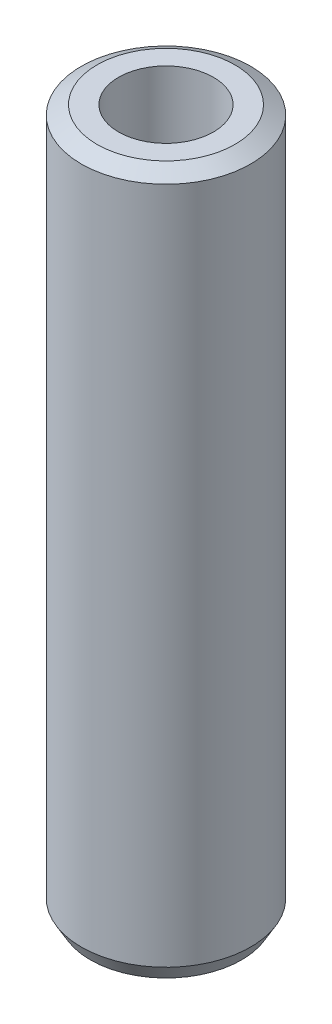
ISO-10303-21;
HEADER;
FILE_DESCRIPTION(('STEP AP214'),'2;1');
FILE_NAME('part.step','',(''),(''),'','','');
FILE_SCHEMA(('AUTOMOTIVE_DESIGN { 1 0 10303 214 1 1 1 1 }'));
ENDSEC;
DATA;
#1=APPLICATION_CONTEXT('core data for automotive mechanical design processes');
#2=APPLICATION_PROTOCOL_DEFINITION('international standard','automotive_design',2000,#1);
#3=PRODUCT_CONTEXT('',#1,'mechanical');
#4=PRODUCT('Part','Part','',(#3));
#5=PRODUCT_RELATED_PRODUCT_CATEGORY('part','',(#4));
#6=PRODUCT_DEFINITION_FORMATION('','',#4);
#7=PRODUCT_DEFINITION_CONTEXT('part definition',#1,'design');
#8=PRODUCT_DEFINITION('design','',#6,#7);
#9=PRODUCT_DEFINITION_SHAPE('','',#8);
#10=(LENGTH_UNIT() NAMED_UNIT(*) SI_UNIT(.MILLI.,.METRE.));
#11=(NAMED_UNIT(*) PLANE_ANGLE_UNIT() SI_UNIT($,.RADIAN.));
#12=(NAMED_UNIT(*) SI_UNIT($,.STERADIAN.) SOLID_ANGLE_UNIT());
#13=UNCERTAINTY_MEASURE_WITH_UNIT(LENGTH_MEASURE(1.E-05),#10,'distance_accuracy_value','');
#14=(GEOMETRIC_REPRESENTATION_CONTEXT(3) GLOBAL_UNCERTAINTY_ASSIGNED_CONTEXT((#13)) GLOBAL_UNIT_ASSIGNED_CONTEXT((#10,
#11,#12)) REPRESENTATION_CONTEXT('',''));
#15=CARTESIAN_POINT('',(0.,0.,0.));
#16=DIRECTION('',(0.,0.,1.));
#17=DIRECTION('',(1.,0.,0.));
#18=AXIS2_PLACEMENT_3D('',#15,#16,#17);
#19=CARTESIAN_POINT('',(0.,124.492116500997,0.));
#20=DIRECTION('',(0.,-1.,0.));
#21=DIRECTION('',(0.,0.,-1.));
#22=AXIS2_PLACEMENT_3D('',#19,#20,#21);
#23=CYLINDRICAL_SURFACE('',#22,15.);
#24=CARTESIAN_POINT('',(0.,122.883751197156,0.));
#25=DIRECTION('',(0.,1.,0.));
#26=DIRECTION('',(0.,0.,1.));
#27=AXIS2_PLACEMENT_3D('',#24,#25,#26);
#28=CIRCLE('',#27,15.);
#29=CARTESIAN_POINT('',(0.,122.883751197156,15.));
#30=VERTEX_POINT('',#29);
#31=EDGE_CURVE('E50',#30,#30,#28,.F.);
#32=ORIENTED_EDGE('',*,*,#31,.T.);
#33=EDGE_LOOP('',(#32));
#34=FACE_BOUND('',#33,.T.);
#35=CARTESIAN_POINT('',(0.,2.78577042338374,0.));
#36=DIRECTION('',(0.,1.,0.));
#37=DIRECTION('',(0.,0.,1.));
#38=AXIS2_PLACEMENT_3D('',#35,#36,#37);
#39=CIRCLE('',#38,15.);
#40=CARTESIAN_POINT('',(0.,2.78577042338374,15.));
#41=VERTEX_POINT('',#40);
#42=EDGE_CURVE('E51',#41,#41,#39,.T.);
#43=ORIENTED_EDGE('',*,*,#42,.T.);
#44=EDGE_LOOP('',(#43));
#45=FACE_BOUND('',#44,.T.);
#46=ADVANCED_FACE('F39',(#34,#45),#23,.T.);
#47=CARTESIAN_POINT('',(0.,124.492116500997,0.));
#48=DIRECTION('',(0.,1.,0.));
#49=DIRECTION('',(0.,0.,1.));
#50=AXIS2_PLACEMENT_3D('',#47,#48,#49);
#51=PLANE('',#50);
#52=CARTESIAN_POINT('',(0.,124.492116500997,0.));
#53=DIRECTION('',(0.,1.,0.));
#54=DIRECTION('',(0.,0.,1.));
#55=AXIS2_PLACEMENT_3D('',#52,#53,#54);
#56=CIRCLE('',#55,12.2142295766163);
#57=CARTESIAN_POINT('',(0.,124.492116500997,12.2142295766163));
#58=VERTEX_POINT('',#57);
#59=EDGE_CURVE('E54',#58,#58,#56,.T.);
#60=ORIENTED_EDGE('',*,*,#59,.T.);
#61=EDGE_LOOP('',(#60));
#62=FACE_BOUND('',#61,.T.);
#63=CARTESIAN_POINT('',(0.,124.492116500997,0.));
#64=DIRECTION('',(0.,1.,0.));
#65=DIRECTION('',(0.,0.,1.));
#66=AXIS2_PLACEMENT_3D('',#63,#64,#65);
#67=CIRCLE('',#66,8.40391912857246);
#68=CARTESIAN_POINT('',(0.,124.492116500997,8.40391912857246));
#69=VERTEX_POINT('',#68);
#70=EDGE_CURVE('E58',#69,#69,#67,.T.);
#71=ORIENTED_EDGE('',*,*,#70,.F.);
#72=EDGE_LOOP('',(#71));
#73=FACE_BOUND('',#72,.T.);
#74=ADVANCED_FACE('F69',(#62,#73),#51,.T.);
#75=CARTESIAN_POINT('',(0.,0.,0.));
#76=DIRECTION('',(0.,1.,0.));
#77=DIRECTION('',(0.,0.,1.));
#78=AXIS2_PLACEMENT_3D('',#75,#76,#77);
#79=PLANE('',#78);
#80=CARTESIAN_POINT('',(0.,0.,0.));
#81=DIRECTION('',(0.,1.,0.));
#82=DIRECTION('',(0.,0.,1.));
#83=AXIS2_PLACEMENT_3D('',#80,#81,#82);
#84=CIRCLE('',#83,13.3916346961589);
#85=CARTESIAN_POINT('',(0.,0.,13.3916346961589));
#86=VERTEX_POINT('',#85);
#87=EDGE_CURVE('E10',#86,#86,#84,.F.);
#88=ORIENTED_EDGE('',*,*,#87,.T.);
#89=EDGE_LOOP('',(#88));
#90=FACE_BOUND('',#89,.T.);
#91=CARTESIAN_POINT('',(0.,0.,0.));
#92=DIRECTION('',(0.,1.,0.));
#93=DIRECTION('',(0.,0.,1.));
#94=AXIS2_PLACEMENT_3D('',#91,#92,#93);
#95=CIRCLE('',#94,8.40391912857246);
#96=CARTESIAN_POINT('',(0.,0.,8.40391912857246));
#97=VERTEX_POINT('',#96);
#98=EDGE_CURVE('E63',#97,#97,#95,.T.);
#99=ORIENTED_EDGE('',*,*,#98,.T.);
#100=EDGE_LOOP('',(#99));
#101=FACE_BOUND('',#100,.T.);
#102=ADVANCED_FACE('F75',(#90,#101),#79,.F.);
#103=CARTESIAN_POINT('',(0.,124.492116500997,0.));
#104=DIRECTION('',(0.,-1.,0.));
#105=DIRECTION('',(0.,0.,-1.));
#106=AXIS2_PLACEMENT_3D('',#103,#104,#105);
#107=CYLINDRICAL_SURFACE('',#106,8.40391912857246);
#108=ORIENTED_EDGE('',*,*,#70,.T.);
#109=EDGE_LOOP('',(#108));
#110=FACE_BOUND('',#109,.T.);
#111=ORIENTED_EDGE('',*,*,#98,.F.);
#112=EDGE_LOOP('',(#111));
#113=FACE_BOUND('',#112,.T.);
#114=ADVANCED_FACE('F70',(#110,#113),#107,.F.);
#115=CARTESIAN_POINT('',(0.,124.492116500997,0.));
#116=DIRECTION('',(0.,-1.,0.));
#117=DIRECTION('',(0.,0.,-1.));
#118=AXIS2_PLACEMENT_3D('',#115,#116,#117);
#119=CONICAL_SURFACE('',#118,12.2142295766163,1.04719755119659);
#120=ORIENTED_EDGE('',*,*,#31,.F.);
#121=EDGE_LOOP('',(#120));
#122=FACE_BOUND('',#121,.T.);
#123=ORIENTED_EDGE('',*,*,#59,.F.);
#124=EDGE_LOOP('',(#123));
#125=FACE_BOUND('',#124,.T.);
#126=ADVANCED_FACE('F81',(#122,#125),#119,.T.);
#127=CARTESIAN_POINT('',(0.,2.78577042338374,0.));
#128=DIRECTION('',(0.,1.,0.));
#129=DIRECTION('',(0.,0.,1.));
#130=AXIS2_PLACEMENT_3D('',#127,#128,#129);
#131=CONICAL_SURFACE('',#130,15.,0.523598775598306);
#132=ORIENTED_EDGE('',*,*,#87,.F.);
#133=EDGE_LOOP('',(#132));
#134=FACE_BOUND('',#133,.T.);
#135=ORIENTED_EDGE('',*,*,#42,.F.);
#136=EDGE_LOOP('',(#135));
#137=FACE_BOUND('',#136,.T.);
#138=ADVANCED_FACE('F45',(#134,#137),#131,.T.);
#139=CLOSED_SHELL('',(#46,#74,#102,#114,#126,#138));
#140=MANIFOLD_SOLID_BREP('B2',#139);
#141=ADVANCED_BREP_SHAPE_REPRESENTATION('',(#18,#140),#14);
#142=SHAPE_DEFINITION_REPRESENTATION(#9,#141);
ENDSEC;
END-ISO-10303-21;
